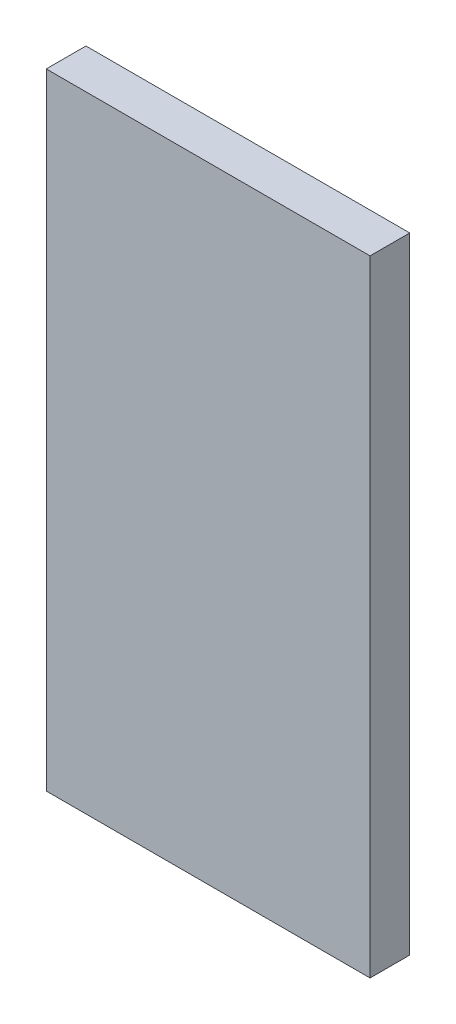
ISO-10303-21;
HEADER;
FILE_DESCRIPTION(('STEP AP214'),'2;1');
FILE_NAME('part.step','',(''),(''),'','','');
FILE_SCHEMA(('AUTOMOTIVE_DESIGN { 1 0 10303 214 1 1 1 1 }'));
ENDSEC;
DATA;
#1=APPLICATION_CONTEXT('core data for automotive mechanical design processes');
#2=APPLICATION_PROTOCOL_DEFINITION('international standard','automotive_design',2000,#1);
#3=PRODUCT_CONTEXT('',#1,'mechanical');
#4=PRODUCT('Part','Part','',(#3));
#5=PRODUCT_RELATED_PRODUCT_CATEGORY('part','',(#4));
#6=PRODUCT_DEFINITION_FORMATION('','',#4);
#7=PRODUCT_DEFINITION_CONTEXT('part definition',#1,'design');
#8=PRODUCT_DEFINITION('design','',#6,#7);
#9=PRODUCT_DEFINITION_SHAPE('','',#8);
#10=(LENGTH_UNIT() NAMED_UNIT(*) SI_UNIT(.MILLI.,.METRE.));
#11=(NAMED_UNIT(*) PLANE_ANGLE_UNIT() SI_UNIT($,.RADIAN.));
#12=(NAMED_UNIT(*) SI_UNIT($,.STERADIAN.) SOLID_ANGLE_UNIT());
#13=UNCERTAINTY_MEASURE_WITH_UNIT(LENGTH_MEASURE(1.E-05),#10,'distance_accuracy_value','');
#14=(GEOMETRIC_REPRESENTATION_CONTEXT(3) GLOBAL_UNCERTAINTY_ASSIGNED_CONTEXT((#13)) GLOBAL_UNIT_ASSIGNED_CONTEXT((#10,
#11,#12)) REPRESENTATION_CONTEXT('',''));
#15=CARTESIAN_POINT('',(0.,0.,0.));
#16=DIRECTION('',(0.,0.,1.));
#17=DIRECTION('',(1.,0.,0.));
#18=AXIS2_PLACEMENT_3D('',#15,#16,#17);
#19=CARTESIAN_POINT('',(2.132,2.122,0.1));
#20=DIRECTION('',(0.,0.,1.));
#21=DIRECTION('',(1.,0.,0.));
#22=AXIS2_PLACEMENT_3D('',#19,#20,#21);
#23=PLANE('',#22);
#24=DIRECTION('',(0.,1.,0.));
#25=VECTOR('',#24,1.);
#26=CARTESIAN_POINT('',(2.948,2.122,0.1));
#27=LINE('',#26,#25);
#28=CARTESIAN_POINT('',(2.948,3.698,0.1));
#29=VERTEX_POINT('',#28);
#30=CARTESIAN_POINT('',(2.948,2.122,0.1));
#31=VERTEX_POINT('',#30);
#32=EDGE_CURVE('E75',#29,#31,#27,.F.);
#33=ORIENTED_EDGE('',*,*,#32,.F.);
#34=DIRECTION('',(1.,0.,0.));
#35=VECTOR('',#34,1.);
#36=CARTESIAN_POINT('',(2.132,3.698,0.1));
#37=LINE('',#36,#35);
#38=CARTESIAN_POINT('',(2.132,3.698,0.1));
#39=VERTEX_POINT('',#38);
#40=EDGE_CURVE('E57',#39,#29,#37,.T.);
#41=ORIENTED_EDGE('',*,*,#40,.F.);
#42=DIRECTION('',(0.,1.,0.));
#43=VECTOR('',#42,1.);
#44=CARTESIAN_POINT('',(2.132,2.122,0.1));
#45=LINE('',#44,#43);
#46=CARTESIAN_POINT('',(2.132,2.122,0.1));
#47=VERTEX_POINT('',#46);
#48=EDGE_CURVE('E19',#39,#47,#45,.F.);
#49=ORIENTED_EDGE('',*,*,#48,.T.);
#50=DIRECTION('',(1.,0.,0.));
#51=VECTOR('',#50,1.);
#52=CARTESIAN_POINT('',(2.132,2.122,0.1));
#53=LINE('',#52,#51);
#54=EDGE_CURVE('E54',#47,#31,#53,.T.);
#55=ORIENTED_EDGE('',*,*,#54,.T.);
#56=EDGE_LOOP('',(#33,#41,#49,#55));
#57=FACE_BOUND('',#56,.T.);
#58=ADVANCED_FACE('F16',(#57),#23,.T.);
#59=CARTESIAN_POINT('',(2.132,2.122,0.));
#60=DIRECTION('',(1.,0.,0.));
#61=DIRECTION('',(0.,0.,-1.));
#62=AXIS2_PLACEMENT_3D('',#59,#60,#61);
#63=PLANE('',#62);
#64=DIRECTION('',(0.,0.,1.));
#65=VECTOR('',#64,1.);
#66=CARTESIAN_POINT('',(2.132,3.698,0.));
#67=LINE('',#66,#65);
#68=CARTESIAN_POINT('',(2.132,3.698,0.));
#69=VERTEX_POINT('',#68);
#70=EDGE_CURVE('E77',#69,#39,#67,.T.);
#71=ORIENTED_EDGE('',*,*,#70,.F.);
#72=DIRECTION('',(0.,1.,0.));
#73=VECTOR('',#72,1.);
#74=CARTESIAN_POINT('',(2.132,2.122,0.));
#75=LINE('',#74,#73);
#76=CARTESIAN_POINT('',(2.132,2.122,0.));
#77=VERTEX_POINT('',#76);
#78=EDGE_CURVE('E72',#69,#77,#75,.F.);
#79=ORIENTED_EDGE('',*,*,#78,.T.);
#80=DIRECTION('',(0.,0.,1.));
#81=VECTOR('',#80,1.);
#82=CARTESIAN_POINT('',(2.132,2.122,0.));
#83=LINE('',#82,#81);
#84=EDGE_CURVE('E62',#77,#47,#83,.T.);
#85=ORIENTED_EDGE('',*,*,#84,.T.);
#86=ORIENTED_EDGE('',*,*,#48,.F.);
#87=EDGE_LOOP('',(#71,#79,#85,#86));
#88=FACE_BOUND('',#87,.T.);
#89=ADVANCED_FACE('F71',(#88),#63,.F.);
#90=CARTESIAN_POINT('',(2.132,2.122,0.));
#91=DIRECTION('',(0.,1.,0.));
#92=DIRECTION('',(0.,0.,1.));
#93=AXIS2_PLACEMENT_3D('',#90,#91,#92);
#94=PLANE('',#93);
#95=ORIENTED_EDGE('',*,*,#54,.F.);
#96=ORIENTED_EDGE('',*,*,#84,.F.);
#97=DIRECTION('',(1.,0.,0.));
#98=VECTOR('',#97,1.);
#99=CARTESIAN_POINT('',(2.132,2.122,0.));
#100=LINE('',#99,#98);
#101=CARTESIAN_POINT('',(2.948,2.122,0.));
#102=VERTEX_POINT('',#101);
#103=EDGE_CURVE('E82',#77,#102,#100,.T.);
#104=ORIENTED_EDGE('',*,*,#103,.T.);
#105=DIRECTION('',(0.,0.,-1.));
#106=VECTOR('',#105,1.);
#107=CARTESIAN_POINT('',(2.948,2.122,0.));
#108=LINE('',#107,#106);
#109=EDGE_CURVE('E68',#31,#102,#108,.T.);
#110=ORIENTED_EDGE('',*,*,#109,.F.);
#111=EDGE_LOOP('',(#95,#96,#104,#110));
#112=FACE_BOUND('',#111,.T.);
#113=ADVANCED_FACE('F65',(#112),#94,.F.);
#114=CARTESIAN_POINT('',(2.948,2.122,0.));
#115=DIRECTION('',(1.,0.,0.));
#116=DIRECTION('',(0.,0.,-1.));
#117=AXIS2_PLACEMENT_3D('',#114,#115,#116);
#118=PLANE('',#117);
#119=DIRECTION('',(0.,0.,1.));
#120=VECTOR('',#119,1.);
#121=CARTESIAN_POINT('',(2.948,3.698,0.));
#122=LINE('',#121,#120);
#123=CARTESIAN_POINT('',(2.948,3.698,0.));
#124=VERTEX_POINT('',#123);
#125=EDGE_CURVE('E33',#29,#124,#122,.F.);
#126=ORIENTED_EDGE('',*,*,#125,.F.);
#127=ORIENTED_EDGE('',*,*,#32,.T.);
#128=ORIENTED_EDGE('',*,*,#109,.T.);
#129=DIRECTION('',(0.,1.,0.));
#130=VECTOR('',#129,1.);
#131=CARTESIAN_POINT('',(2.948,2.122,0.));
#132=LINE('',#131,#130);
#133=EDGE_CURVE('E25',#102,#124,#132,.T.);
#134=ORIENTED_EDGE('',*,*,#133,.T.);
#135=EDGE_LOOP('',(#126,#127,#128,#134));
#136=FACE_BOUND('',#135,.T.);
#137=ADVANCED_FACE('F87',(#136),#118,.T.);
#138=CARTESIAN_POINT('',(2.132,3.698,0.));
#139=DIRECTION('',(0.,1.,0.));
#140=DIRECTION('',(0.,0.,1.));
#141=AXIS2_PLACEMENT_3D('',#138,#139,#140);
#142=PLANE('',#141);
#143=ORIENTED_EDGE('',*,*,#40,.T.);
#144=ORIENTED_EDGE('',*,*,#125,.T.);
#145=DIRECTION('',(1.,0.,0.));
#146=VECTOR('',#145,1.);
#147=CARTESIAN_POINT('',(2.132,3.698,0.));
#148=LINE('',#147,#146);
#149=EDGE_CURVE('E11',#124,#69,#148,.F.);
#150=ORIENTED_EDGE('',*,*,#149,.T.);
#151=ORIENTED_EDGE('',*,*,#70,.T.);
#152=EDGE_LOOP('',(#143,#144,#150,#151));
#153=FACE_BOUND('',#152,.T.);
#154=ADVANCED_FACE('F90',(#153),#142,.T.);
#155=CARTESIAN_POINT('',(2.132,2.122,0.));
#156=DIRECTION('',(0.,0.,1.));
#157=DIRECTION('',(1.,0.,0.));
#158=AXIS2_PLACEMENT_3D('',#155,#156,#157);
#159=PLANE('',#158);
#160=ORIENTED_EDGE('',*,*,#133,.F.);
#161=ORIENTED_EDGE('',*,*,#103,.F.);
#162=ORIENTED_EDGE('',*,*,#78,.F.);
#163=ORIENTED_EDGE('',*,*,#149,.F.);
#164=EDGE_LOOP('',(#160,#161,#162,#163));
#165=FACE_BOUND('',#164,.T.);
#166=ADVANCED_FACE('F89',(#165),#159,.F.);
#167=CLOSED_SHELL('',(#58,#89,#113,#137,#154,#166));
#168=MANIFOLD_SOLID_BREP('B1',#167);
#169=ADVANCED_BREP_SHAPE_REPRESENTATION('',(#18,#168),#14);
#170=SHAPE_DEFINITION_REPRESENTATION(#9,#169);
ENDSEC;
END-ISO-10303-21;
